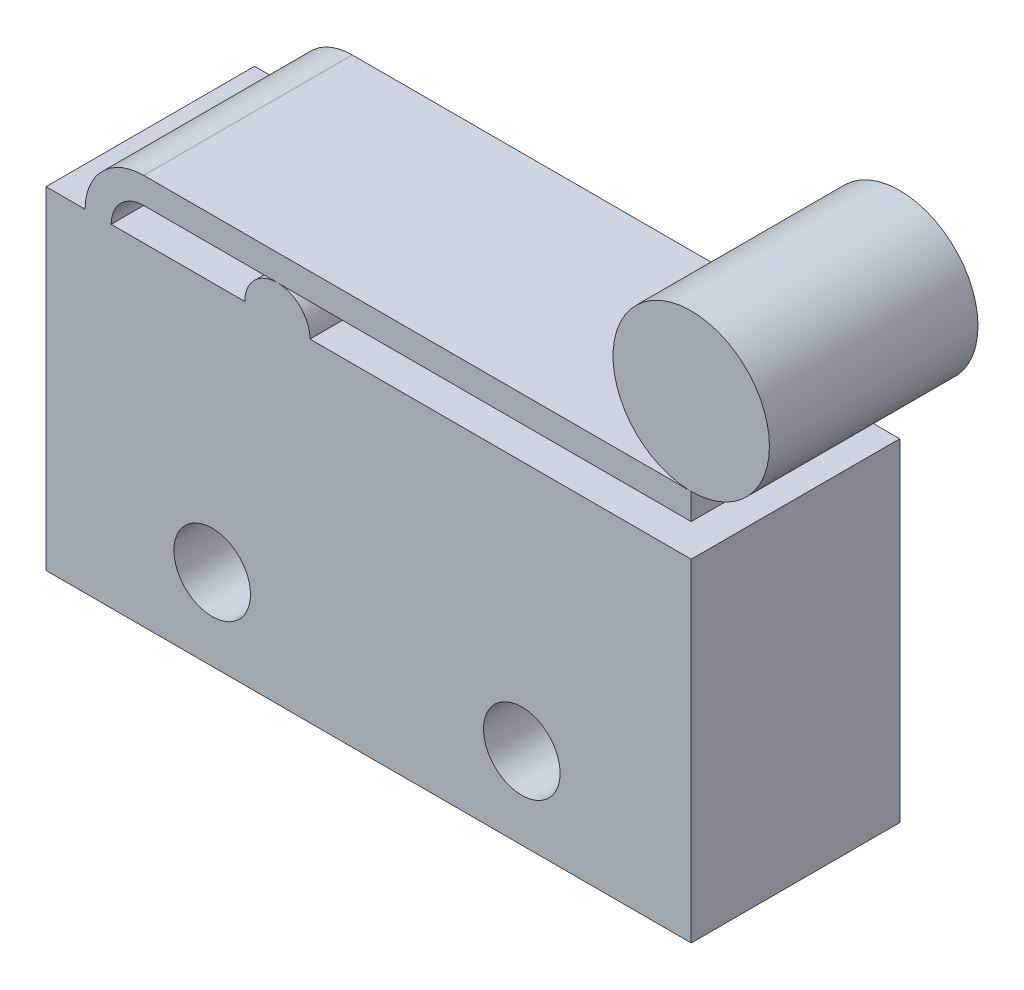
ISO-10303-21;
HEADER;
FILE_DESCRIPTION(('STEP AP214'),'2;1');
FILE_NAME('part.step','',(''),(''),'','','');
FILE_SCHEMA(('AUTOMOTIVE_DESIGN { 1 0 10303 214 1 1 1 1 }'));
ENDSEC;
DATA;
#1=APPLICATION_CONTEXT('core data for automotive mechanical design processes');
#2=APPLICATION_PROTOCOL_DEFINITION('international standard','automotive_design',2000,#1);
#3=PRODUCT_CONTEXT('',#1,'mechanical');
#4=PRODUCT('Part','Part','',(#3));
#5=PRODUCT_RELATED_PRODUCT_CATEGORY('part','',(#4));
#6=PRODUCT_DEFINITION_FORMATION('','',#4);
#7=PRODUCT_DEFINITION_CONTEXT('part definition',#1,'design');
#8=PRODUCT_DEFINITION('design','',#6,#7);
#9=PRODUCT_DEFINITION_SHAPE('','',#8);
#10=(LENGTH_UNIT() NAMED_UNIT(*) SI_UNIT(.MILLI.,.METRE.));
#11=(NAMED_UNIT(*) PLANE_ANGLE_UNIT() SI_UNIT($,.RADIAN.));
#12=(NAMED_UNIT(*) SI_UNIT($,.STERADIAN.) SOLID_ANGLE_UNIT());
#13=UNCERTAINTY_MEASURE_WITH_UNIT(LENGTH_MEASURE(1.E-05),#10,'distance_accuracy_value','');
#14=(GEOMETRIC_REPRESENTATION_CONTEXT(3) GLOBAL_UNCERTAINTY_ASSIGNED_CONTEXT((#13)) GLOBAL_UNIT_ASSIGNED_CONTEXT((#10,
#11,#12)) REPRESENTATION_CONTEXT('',''));
#15=CARTESIAN_POINT('',(0.,0.,0.));
#16=DIRECTION('',(0.,0.,1.));
#17=DIRECTION('',(1.,0.,0.));
#18=AXIS2_PLACEMENT_3D('',#15,#16,#17);
#19=CARTESIAN_POINT('',(19.8,14.4,6.4));
#20=DIRECTION('',(0.,0.,1.));
#21=DIRECTION('',(1.,0.,0.));
#22=AXIS2_PLACEMENT_3D('',#19,#20,#21);
#23=PLANE('',#22);
#24=CARTESIAN_POINT('',(19.8,14.4,6.4));
#25=DIRECTION('',(0.,0.,1.));
#26=DIRECTION('',(1.,0.,0.));
#27=AXIS2_PLACEMENT_3D('',#24,#25,#26);
#28=CIRCLE('',#27,2.4);
#29=CARTESIAN_POINT('',(22.2,14.4,6.4));
#30=VERTEX_POINT('',#29);
#31=EDGE_CURVE('P0_E18',#30,#30,#28,.F.);
#32=ORIENTED_EDGE('',*,*,#31,.F.);
#33=EDGE_LOOP('',(#32));
#34=FACE_BOUND('',#33,.T.);
#35=ADVANCED_FACE('P0_F15',(#34),#23,.T.);
#36=CARTESIAN_POINT('',(19.8,14.4,0.));
#37=DIRECTION('',(0.,0.,1.));
#38=DIRECTION('',(1.,0.,0.));
#39=AXIS2_PLACEMENT_3D('',#36,#37,#38);
#40=PLANE('',#39);
#41=CARTESIAN_POINT('',(19.8,14.4,0.));
#42=DIRECTION('',(0.,0.,1.));
#43=DIRECTION('',(1.,0.,0.));
#44=AXIS2_PLACEMENT_3D('',#41,#42,#43);
#45=CIRCLE('',#44,2.4);
#46=CARTESIAN_POINT('',(22.2,14.4,0.));
#47=VERTEX_POINT('',#46);
#48=EDGE_CURVE('P0_E10',#47,#47,#45,.T.);
#49=ORIENTED_EDGE('',*,*,#48,.F.);
#50=EDGE_LOOP('',(#49));
#51=FACE_BOUND('',#50,.T.);
#52=ADVANCED_FACE('P0_F30',(#51),#40,.F.);
#53=CARTESIAN_POINT('',(19.8,14.4,0.));
#54=DIRECTION('',(0.,0.,1.));
#55=DIRECTION('',(1.,0.,0.));
#56=AXIS2_PLACEMENT_3D('',#53,#54,#55);
#57=CYLINDRICAL_SURFACE('',#56,2.4);
#58=ORIENTED_EDGE('',*,*,#31,.T.);
#59=EDGE_LOOP('',(#58));
#60=FACE_BOUND('',#59,.T.);
#61=ORIENTED_EDGE('',*,*,#48,.T.);
#62=EDGE_LOOP('',(#61));
#63=FACE_BOUND('',#62,.T.);
#64=ADVANCED_FACE('P0_F27',(#60,#63),#57,.T.);
#65=CLOSED_SHELL('',(#35,#52,#64));
#66=MANIFOLD_SOLID_BREP('P0_B1',#65);
#67=CARTESIAN_POINT('',(9.9,6.00000008940697,0.));
#68=DIRECTION('',(0.,0.,1.));
#69=DIRECTION('',(1.,0.,0.));
#70=AXIS2_PLACEMENT_3D('',#67,#68,#69);
#71=PLANE('',#70);
#72=CARTESIAN_POINT('',(3.00000004470348,10.2,0.));
#73=DIRECTION('',(0.,0.,1.));
#74=DIRECTION('',(1.,0.,0.));
#75=AXIS2_PLACEMENT_3D('',#72,#73,#74);
#76=CIRCLE('',#75,1.);
#77=CARTESIAN_POINT('',(3.00000004470348,11.2,0.));
#78=VERTEX_POINT('',#77);
#79=CARTESIAN_POINT('',(2.00000004470348,10.2,0.));
#80=VERTEX_POINT('',#79);
#81=EDGE_CURVE('P1_E33',#78,#80,#76,.T.);
#82=ORIENTED_EDGE('',*,*,#81,.F.);
#83=DIRECTION('',(1.,0.,0.));
#84=VECTOR('',#83,1.);
#85=CARTESIAN_POINT('',(9.9,11.2,0.));
#86=LINE('',#85,#84);
#87=CARTESIAN_POINT('',(7.1,11.2,0.));
#88=VERTEX_POINT('',#87);
#89=EDGE_CURVE('P1_E11',#78,#88,#86,.T.);
#90=ORIENTED_EDGE('',*,*,#89,.T.);
#91=CARTESIAN_POINT('',(7.1,10.2,0.));
#92=DIRECTION('',(0.,0.,1.));
#93=DIRECTION('',(1.,0.,0.));
#94=AXIS2_PLACEMENT_3D('',#91,#92,#93);
#95=CIRCLE('',#94,1.);
#96=CARTESIAN_POINT('',(6.1,10.2,0.));
#97=VERTEX_POINT('',#96);
#98=EDGE_CURVE('P1_E148',#88,#97,#95,.T.);
#99=ORIENTED_EDGE('',*,*,#98,.T.);
#100=DIRECTION('',(1.,0.,0.));
#101=VECTOR('',#100,1.);
#102=CARTESIAN_POINT('',(9.9,10.2,0.));
#103=LINE('',#102,#101);
#104=EDGE_CURVE('P1_E25',#97,#80,#103,.F.);
#105=ORIENTED_EDGE('',*,*,#104,.T.);
#106=EDGE_LOOP('',(#82,#90,#99,#105));
#107=FACE_BOUND('',#106,.T.);
#108=CARTESIAN_POINT('',(5.1,2.5,0.));
#109=DIRECTION('',(0.,0.,1.));
#110=DIRECTION('',(1.,0.,0.));
#111=AXIS2_PLACEMENT_3D('',#108,#109,#110);
#112=CIRCLE('',#111,1.175);
#113=CARTESIAN_POINT('',(6.275,2.5,0.));
#114=VERTEX_POINT('',#113);
#115=EDGE_CURVE('P1_E155',#114,#114,#112,.F.);
#116=ORIENTED_EDGE('',*,*,#115,.T.);
#117=EDGE_LOOP('',(#116));
#118=FACE_BOUND('',#117,.T.);
#119=CARTESIAN_POINT('',(14.6,2.5,0.));
#120=DIRECTION('',(0.,0.,1.));
#121=DIRECTION('',(1.,0.,0.));
#122=AXIS2_PLACEMENT_3D('',#119,#120,#121);
#123=CIRCLE('',#122,1.175);
#124=CARTESIAN_POINT('',(15.775,2.5,0.));
#125=VERTEX_POINT('',#124);
#126=EDGE_CURVE('P1_E158',#125,#125,#123,.F.);
#127=ORIENTED_EDGE('',*,*,#126,.T.);
#128=EDGE_LOOP('',(#127));
#129=FACE_BOUND('',#128,.T.);
#130=DIRECTION('',(0.,1.,0.));
#131=VECTOR('',#130,1.);
#132=CARTESIAN_POINT('',(0.,6.00000008940697,0.));
#133=LINE('',#132,#131);
#134=CARTESIAN_POINT('',(0.,10.2,0.));
#135=VERTEX_POINT('',#134);
#136=CARTESIAN_POINT('',(0.,0.,0.));
#137=VERTEX_POINT('',#136);
#138=EDGE_CURVE('P1_E164',#135,#137,#133,.F.);
#139=ORIENTED_EDGE('',*,*,#138,.T.);
#140=DIRECTION('',(1.,0.,0.));
#141=VECTOR('',#140,1.);
#142=CARTESIAN_POINT('',(9.9,0.,0.));
#143=LINE('',#142,#141);
#144=CARTESIAN_POINT('',(19.8,0.,0.));
#145=VERTEX_POINT('',#144);
#146=EDGE_CURVE('P1_E161',#137,#145,#143,.T.);
#147=ORIENTED_EDGE('',*,*,#146,.T.);
#148=DIRECTION('',(0.,1.,0.));
#149=VECTOR('',#148,1.);
#150=CARTESIAN_POINT('',(19.8,6.00000008940697,0.));
#151=LINE('',#150,#149);
#152=CARTESIAN_POINT('',(19.8,10.2,0.));
#153=VERTEX_POINT('',#152);
#154=EDGE_CURVE('P1_E177',#145,#153,#151,.T.);
#155=ORIENTED_EDGE('',*,*,#154,.T.);
#156=DIRECTION('',(1.,0.,0.));
#157=VECTOR('',#156,1.);
#158=CARTESIAN_POINT('',(9.9,10.2,0.));
#159=LINE('',#158,#157);
#160=CARTESIAN_POINT('',(8.1,10.2,0.));
#161=VERTEX_POINT('',#160);
#162=EDGE_CURVE('P1_E135',#153,#161,#159,.F.);
#163=ORIENTED_EDGE('',*,*,#162,.T.);
#164=CARTESIAN_POINT('',(7.1,10.2,0.));
#165=DIRECTION('',(0.,0.,1.));
#166=DIRECTION('',(1.,0.,0.));
#167=AXIS2_PLACEMENT_3D('',#164,#165,#166);
#168=CIRCLE('',#167,1.);
#169=CARTESIAN_POINT('',(7.1,11.2,0.));
#170=VERTEX_POINT('',#169);
#171=EDGE_CURVE('P1_E20',#161,#170,#168,.T.);
#172=ORIENTED_EDGE('',*,*,#171,.T.);
#173=DIRECTION('',(1.,0.,0.));
#174=VECTOR('',#173,1.);
#175=CARTESIAN_POINT('',(9.9,11.2,0.));
#176=LINE('',#175,#174);
#177=CARTESIAN_POINT('',(19.8,11.2,0.));
#178=VERTEX_POINT('',#177);
#179=EDGE_CURVE('P1_E173',#170,#178,#176,.T.);
#180=ORIENTED_EDGE('',*,*,#179,.T.);
#181=DIRECTION('',(0.,1.,0.));
#182=VECTOR('',#181,1.);
#183=CARTESIAN_POINT('',(19.8,6.00000008940697,0.));
#184=LINE('',#183,#182);
#185=CARTESIAN_POINT('',(19.8,12.0000001788139,0.));
#186=VERTEX_POINT('',#185);
#187=EDGE_CURVE('P1_E152',#178,#186,#184,.T.);
#188=ORIENTED_EDGE('',*,*,#187,.T.);
#189=DIRECTION('',(1.,0.,0.));
#190=VECTOR('',#189,1.);
#191=CARTESIAN_POINT('',(9.9,12.0000001788139,0.));
#192=LINE('',#191,#190);
#193=CARTESIAN_POINT('',(3.00000004470348,12.0000001788139,0.));
#194=VERTEX_POINT('',#193);
#195=EDGE_CURVE('P1_E170',#186,#194,#192,.F.);
#196=ORIENTED_EDGE('',*,*,#195,.T.);
#197=CARTESIAN_POINT('',(3.00000004470348,10.2,0.));
#198=DIRECTION('',(0.,0.,1.));
#199=DIRECTION('',(1.,0.,0.));
#200=AXIS2_PLACEMENT_3D('',#197,#198,#199);
#201=CIRCLE('',#200,1.80000017881393);
#202=CARTESIAN_POINT('',(1.19999986588955,10.2,0.));
#203=VERTEX_POINT('',#202);
#204=EDGE_CURVE('P1_E167',#194,#203,#201,.T.);
#205=ORIENTED_EDGE('',*,*,#204,.T.);
#206=DIRECTION('',(1.,0.,0.));
#207=VECTOR('',#206,1.);
#208=CARTESIAN_POINT('',(9.9,10.2,0.));
#209=LINE('',#208,#207);
#210=EDGE_CURVE('P1_E223',#203,#135,#209,.F.);
#211=ORIENTED_EDGE('',*,*,#210,.T.);
#212=EDGE_LOOP('',(#139,#147,#155,#163,#172,#180,#188,#196,#205,#211));
#213=FACE_BOUND('',#212,.T.);
#214=ADVANCED_FACE('P1_F17',(#107,#118,#129,#213),#71,.T.);
#215=CARTESIAN_POINT('',(3.00000004470348,11.2,0.));
#216=DIRECTION('',(0.,-1.,0.));
#217=DIRECTION('',(0.,0.,-1.));
#218=AXIS2_PLACEMENT_3D('',#215,#216,#217);
#219=PLANE('',#218);
#220=DIRECTION('',(1.,0.,0.));
#221=VECTOR('',#220,1.);
#222=CARTESIAN_POINT('',(9.9,11.2,6.4));
#223=LINE('',#222,#221);
#224=CARTESIAN_POINT('',(7.1,11.2,6.4));
#225=VERTEX_POINT('',#224);
#226=CARTESIAN_POINT('',(3.00000004470348,11.2,6.4));
#227=VERTEX_POINT('',#226);
#228=EDGE_CURVE('P1_E180',#225,#227,#223,.F.);
#229=ORIENTED_EDGE('',*,*,#228,.F.);
#230=DIRECTION('',(0.,0.,-1.));
#231=VECTOR('',#230,1.);
#232=CARTESIAN_POINT('',(7.1,11.2,0.));
#233=LINE('',#232,#231);
#234=EDGE_CURVE('P1_E182',#88,#225,#233,.F.);
#235=ORIENTED_EDGE('',*,*,#234,.F.);
#236=ORIENTED_EDGE('',*,*,#89,.F.);
#237=DIRECTION('',(0.,0.,-1.));
#238=VECTOR('',#237,1.);
#239=CARTESIAN_POINT('',(3.00000004470348,11.2,0.));
#240=LINE('',#239,#238);
#241=EDGE_CURVE('P1_E179',#227,#78,#240,.T.);
#242=ORIENTED_EDGE('',*,*,#241,.F.);
#243=EDGE_LOOP('',(#229,#235,#236,#242));
#244=FACE_BOUND('',#243,.T.);
#245=ADVANCED_FACE('P1_F313',(#244),#219,.F.);
#246=CARTESIAN_POINT('',(6.1,10.2,0.));
#247=DIRECTION('',(0.,1.,0.));
#248=DIRECTION('',(0.,0.,1.));
#249=AXIS2_PLACEMENT_3D('',#246,#247,#248);
#250=PLANE('',#249);
#251=DIRECTION('',(1.,0.,0.));
#252=VECTOR('',#251,1.);
#253=CARTESIAN_POINT('',(9.9,10.2,6.4));
#254=LINE('',#253,#252);
#255=CARTESIAN_POINT('',(2.00000004470348,10.2,6.4));
#256=VERTEX_POINT('',#255);
#257=CARTESIAN_POINT('',(6.1,10.2,6.4));
#258=VERTEX_POINT('',#257);
#259=EDGE_CURVE('P1_E183',#256,#258,#254,.T.);
#260=ORIENTED_EDGE('',*,*,#259,.F.);
#261=DIRECTION('',(0.,0.,1.));
#262=VECTOR('',#261,1.);
#263=CARTESIAN_POINT('',(2.00000004470348,10.2,0.));
#264=LINE('',#263,#262);
#265=EDGE_CURVE('P1_E187',#80,#256,#264,.T.);
#266=ORIENTED_EDGE('',*,*,#265,.F.);
#267=ORIENTED_EDGE('',*,*,#104,.F.);
#268=DIRECTION('',(0.,0.,1.));
#269=VECTOR('',#268,1.);
#270=CARTESIAN_POINT('',(6.1,10.2,0.));
#271=LINE('',#270,#269);
#272=EDGE_CURVE('P1_E186',#258,#97,#271,.F.);
#273=ORIENTED_EDGE('',*,*,#272,.F.);
#274=EDGE_LOOP('',(#260,#266,#267,#273));
#275=FACE_BOUND('',#274,.T.);
#276=ADVANCED_FACE('P1_F309',(#275),#250,.F.);
#277=CARTESIAN_POINT('',(5.1,2.5,0.));
#278=DIRECTION('',(0.,0.,1.));
#279=DIRECTION('',(1.,0.,0.));
#280=AXIS2_PLACEMENT_3D('',#277,#278,#279);
#281=CYLINDRICAL_SURFACE('',#280,1.175);
#282=ORIENTED_EDGE('',*,*,#115,.F.);
#283=EDGE_LOOP('',(#282));
#284=FACE_BOUND('',#283,.T.);
#285=CARTESIAN_POINT('',(5.1,2.5,6.4));
#286=DIRECTION('',(0.,0.,1.));
#287=DIRECTION('',(1.,0.,0.));
#288=AXIS2_PLACEMENT_3D('',#285,#286,#287);
#289=CIRCLE('',#288,1.175);
#290=CARTESIAN_POINT('',(6.275,2.5,6.4));
#291=VERTEX_POINT('',#290);
#292=EDGE_CURVE('P1_E188',#291,#291,#289,.F.);
#293=ORIENTED_EDGE('',*,*,#292,.T.);
#294=EDGE_LOOP('',(#293));
#295=FACE_BOUND('',#294,.T.);
#296=ADVANCED_FACE('P1_F305',(#284,#295),#281,.T.);
#297=CARTESIAN_POINT('',(14.6,2.5,0.));
#298=DIRECTION('',(0.,0.,1.));
#299=DIRECTION('',(1.,0.,0.));
#300=AXIS2_PLACEMENT_3D('',#297,#298,#299);
#301=CYLINDRICAL_SURFACE('',#300,1.175);
#302=ORIENTED_EDGE('',*,*,#126,.F.);
#303=EDGE_LOOP('',(#302));
#304=FACE_BOUND('',#303,.T.);
#305=CARTESIAN_POINT('',(14.6,2.5,6.4));
#306=DIRECTION('',(0.,0.,1.));
#307=DIRECTION('',(1.,0.,0.));
#308=AXIS2_PLACEMENT_3D('',#305,#306,#307);
#309=CIRCLE('',#308,1.175);
#310=CARTESIAN_POINT('',(15.775,2.5,6.4));
#311=VERTEX_POINT('',#310);
#312=EDGE_CURVE('P1_E191',#311,#311,#309,.F.);
#313=ORIENTED_EDGE('',*,*,#312,.T.);
#314=EDGE_LOOP('',(#313));
#315=FACE_BOUND('',#314,.T.);
#316=ADVANCED_FACE('P1_F302',(#304,#315),#301,.T.);
#317=CARTESIAN_POINT('',(0.,0.,0.));
#318=DIRECTION('',(0.,-1.,0.));
#319=DIRECTION('',(0.,0.,-1.));
#320=AXIS2_PLACEMENT_3D('',#317,#318,#319);
#321=PLANE('',#320);
#322=DIRECTION('',(1.,0.,0.));
#323=VECTOR('',#322,1.);
#324=CARTESIAN_POINT('',(9.9,0.,6.4));
#325=LINE('',#324,#323);
#326=CARTESIAN_POINT('',(19.8,0.,6.4));
#327=VERTEX_POINT('',#326);
#328=CARTESIAN_POINT('',(0.,0.,6.4));
#329=VERTEX_POINT('',#328);
#330=EDGE_CURVE('P1_E195',#327,#329,#325,.F.);
#331=ORIENTED_EDGE('',*,*,#330,.F.);
#332=DIRECTION('',(0.,0.,-1.));
#333=VECTOR('',#332,1.);
#334=CARTESIAN_POINT('',(19.8,0.,0.));
#335=LINE('',#334,#333);
#336=EDGE_CURVE('P1_E130',#145,#327,#335,.F.);
#337=ORIENTED_EDGE('',*,*,#336,.F.);
#338=ORIENTED_EDGE('',*,*,#146,.F.);
#339=DIRECTION('',(0.,0.,-1.));
#340=VECTOR('',#339,1.);
#341=CARTESIAN_POINT('',(0.,0.,0.));
#342=LINE('',#341,#340);
#343=EDGE_CURVE('P1_E194',#329,#137,#342,.T.);
#344=ORIENTED_EDGE('',*,*,#343,.F.);
#345=EDGE_LOOP('',(#331,#337,#338,#344));
#346=FACE_BOUND('',#345,.T.);
#347=ADVANCED_FACE('P1_F260',(#346),#321,.F.);
#348=CARTESIAN_POINT('',(0.,10.2,0.));
#349=DIRECTION('',(-1.,0.,0.));
#350=DIRECTION('',(0.,0.,1.));
#351=AXIS2_PLACEMENT_3D('',#348,#349,#350);
#352=PLANE('',#351);
#353=DIRECTION('',(0.,1.,0.));
#354=VECTOR('',#353,1.);
#355=CARTESIAN_POINT('',(0.,6.00000008940697,6.4));
#356=LINE('',#355,#354);
#357=CARTESIAN_POINT('',(0.,10.2,6.4));
#358=VERTEX_POINT('',#357);
#359=EDGE_CURVE('P1_E197',#329,#358,#356,.T.);
#360=ORIENTED_EDGE('',*,*,#359,.F.);
#361=ORIENTED_EDGE('',*,*,#343,.T.);
#362=ORIENTED_EDGE('',*,*,#138,.F.);
#363=DIRECTION('',(0.,0.,1.));
#364=VECTOR('',#363,1.);
#365=CARTESIAN_POINT('',(0.,10.2,0.));
#366=LINE('',#365,#364);
#367=EDGE_CURVE('P1_E200',#358,#135,#366,.F.);
#368=ORIENTED_EDGE('',*,*,#367,.F.);
#369=EDGE_LOOP('',(#360,#361,#362,#368));
#370=FACE_BOUND('',#369,.T.);
#371=ADVANCED_FACE('P1_F254',(#370),#352,.F.);
#372=CARTESIAN_POINT('',(3.00000004470348,10.2,0.));
#373=DIRECTION('',(0.,0.,1.));
#374=DIRECTION('',(1.,0.,0.));
#375=AXIS2_PLACEMENT_3D('',#372,#373,#374);
#376=CYLINDRICAL_SURFACE('',#375,1.80000017881393);
#377=CARTESIAN_POINT('',(3.00000004470348,10.2,6.4));
#378=DIRECTION('',(0.,0.,1.));
#379=DIRECTION('',(1.,0.,0.));
#380=AXIS2_PLACEMENT_3D('',#377,#378,#379);
#381=CIRCLE('',#380,1.80000017881393);
#382=CARTESIAN_POINT('',(1.19999986588955,10.2,6.4));
#383=VERTEX_POINT('',#382);
#384=CARTESIAN_POINT('',(3.00000004470348,12.0000001788139,6.4));
#385=VERTEX_POINT('',#384);
#386=EDGE_CURVE('P1_E202',#383,#385,#381,.F.);
#387=ORIENTED_EDGE('',*,*,#386,.F.);
#388=DIRECTION('',(0.,0.,1.));
#389=VECTOR('',#388,1.);
#390=CARTESIAN_POINT('',(1.19999986588955,10.2,0.));
#391=LINE('',#390,#389);
#392=EDGE_CURVE('P1_E204',#203,#383,#391,.T.);
#393=ORIENTED_EDGE('',*,*,#392,.F.);
#394=ORIENTED_EDGE('',*,*,#204,.F.);
#395=DIRECTION('',(0.,0.,1.));
#396=VECTOR('',#395,1.);
#397=CARTESIAN_POINT('',(3.00000004470348,12.0000001788139,0.));
#398=LINE('',#397,#396);
#399=EDGE_CURVE('P1_E201',#385,#194,#398,.F.);
#400=ORIENTED_EDGE('',*,*,#399,.F.);
#401=EDGE_LOOP('',(#387,#393,#394,#400));
#402=FACE_BOUND('',#401,.T.);
#403=ADVANCED_FACE('P1_F244',(#402),#376,.F.);
#404=CARTESIAN_POINT('',(19.8,12.0000001788139,0.));
#405=DIRECTION('',(0.,1.,0.));
#406=DIRECTION('',(0.,0.,1.));
#407=AXIS2_PLACEMENT_3D('',#404,#405,#406);
#408=PLANE('',#407);
#409=DIRECTION('',(1.,0.,0.));
#410=VECTOR('',#409,1.);
#411=CARTESIAN_POINT('',(9.9,12.0000001788139,6.4));
#412=LINE('',#411,#410);
#413=CARTESIAN_POINT('',(19.8,12.0000001788139,6.4));
#414=VERTEX_POINT('',#413);
#415=EDGE_CURVE('P1_E205',#385,#414,#412,.T.);
#416=ORIENTED_EDGE('',*,*,#415,.F.);
#417=ORIENTED_EDGE('',*,*,#399,.T.);
#418=ORIENTED_EDGE('',*,*,#195,.F.);
#419=DIRECTION('',(0.,0.,1.));
#420=VECTOR('',#419,1.);
#421=CARTESIAN_POINT('',(19.8,12.0000001788139,0.));
#422=LINE('',#421,#420);
#423=EDGE_CURVE('P1_E208',#414,#186,#422,.F.);
#424=ORIENTED_EDGE('',*,*,#423,.F.);
#425=EDGE_LOOP('',(#416,#417,#418,#424));
#426=FACE_BOUND('',#425,.T.);
#427=ADVANCED_FACE('P1_F237',(#426),#408,.F.);
#428=CARTESIAN_POINT('',(7.1,11.2,0.));
#429=DIRECTION('',(0.,-1.,0.));
#430=DIRECTION('',(0.,0.,-1.));
#431=AXIS2_PLACEMENT_3D('',#428,#429,#430);
#432=PLANE('',#431);
#433=DIRECTION('',(1.,0.,0.));
#434=VECTOR('',#433,1.);
#435=CARTESIAN_POINT('',(9.9,11.2,6.4));
#436=LINE('',#435,#434);
#437=CARTESIAN_POINT('',(19.8,11.2,6.4));
#438=VERTEX_POINT('',#437);
#439=CARTESIAN_POINT('',(7.1,11.2,6.4));
#440=VERTEX_POINT('',#439);
#441=EDGE_CURVE('P1_E139',#438,#440,#436,.F.);
#442=ORIENTED_EDGE('',*,*,#441,.F.);
#443=DIRECTION('',(0.,0.,-1.));
#444=VECTOR('',#443,1.);
#445=CARTESIAN_POINT('',(19.8,11.2,0.));
#446=LINE('',#445,#444);
#447=EDGE_CURVE('P1_E137',#178,#438,#446,.F.);
#448=ORIENTED_EDGE('',*,*,#447,.F.);
#449=ORIENTED_EDGE('',*,*,#179,.F.);
#450=DIRECTION('',(0.,0.,-1.));
#451=VECTOR('',#450,1.);
#452=CARTESIAN_POINT('',(7.1,11.2,0.));
#453=LINE('',#452,#451);
#454=EDGE_CURVE('P1_E209',#440,#170,#453,.T.);
#455=ORIENTED_EDGE('',*,*,#454,.F.);
#456=EDGE_LOOP('',(#442,#448,#449,#455));
#457=FACE_BOUND('',#456,.T.);
#458=ADVANCED_FACE('P1_F266',(#457),#432,.F.);
#459=CARTESIAN_POINT('',(19.8,10.2,0.));
#460=DIRECTION('',(0.,1.,0.));
#461=DIRECTION('',(0.,0.,1.));
#462=AXIS2_PLACEMENT_3D('',#459,#460,#461);
#463=PLANE('',#462);
#464=DIRECTION('',(1.,0.,0.));
#465=VECTOR('',#464,1.);
#466=CARTESIAN_POINT('',(9.9,10.2,6.4));
#467=LINE('',#466,#465);
#468=CARTESIAN_POINT('',(8.1,10.2,6.4));
#469=VERTEX_POINT('',#468);
#470=CARTESIAN_POINT('',(19.8,10.2,6.4));
#471=VERTEX_POINT('',#470);
#472=EDGE_CURVE('P1_E118',#469,#471,#467,.T.);
#473=ORIENTED_EDGE('',*,*,#472,.F.);
#474=DIRECTION('',(0.,0.,1.));
#475=VECTOR('',#474,1.);
#476=CARTESIAN_POINT('',(8.1,10.2,0.));
#477=LINE('',#476,#475);
#478=EDGE_CURVE('P1_E126',#161,#469,#477,.T.);
#479=ORIENTED_EDGE('',*,*,#478,.F.);
#480=ORIENTED_EDGE('',*,*,#162,.F.);
#481=DIRECTION('',(0.,0.,1.));
#482=VECTOR('',#481,1.);
#483=CARTESIAN_POINT('',(19.8,10.2,0.));
#484=LINE('',#483,#482);
#485=EDGE_CURVE('P1_E105',#471,#153,#484,.F.);
#486=ORIENTED_EDGE('',*,*,#485,.F.);
#487=EDGE_LOOP('',(#473,#479,#480,#486));
#488=FACE_BOUND('',#487,.T.);
#489=ADVANCED_FACE('P1_F133',(#488),#463,.F.);
#490=CARTESIAN_POINT('',(19.8,0.,0.));
#491=DIRECTION('',(1.,0.,0.));
#492=DIRECTION('',(0.,0.,-1.));
#493=AXIS2_PLACEMENT_3D('',#490,#491,#492);
#494=PLANE('',#493);
#495=DIRECTION('',(0.,1.,0.));
#496=VECTOR('',#495,1.);
#497=CARTESIAN_POINT('',(19.8,6.00000008940697,6.4));
#498=LINE('',#497,#496);
#499=EDGE_CURVE('P1_E121',#471,#327,#498,.F.);
#500=ORIENTED_EDGE('',*,*,#499,.F.);
#501=ORIENTED_EDGE('',*,*,#485,.T.);
#502=ORIENTED_EDGE('',*,*,#154,.F.);
#503=ORIENTED_EDGE('',*,*,#336,.T.);
#504=EDGE_LOOP('',(#500,#501,#502,#503));
#505=FACE_BOUND('',#504,.T.);
#506=ADVANCED_FACE('P1_F128',(#505),#494,.F.);
#507=CARTESIAN_POINT('',(3.00000004470348,10.2,0.));
#508=DIRECTION('',(0.,0.,1.));
#509=DIRECTION('',(1.,0.,0.));
#510=AXIS2_PLACEMENT_3D('',#507,#508,#509);
#511=CYLINDRICAL_SURFACE('',#510,1.);
#512=ORIENTED_EDGE('',*,*,#241,.T.);
#513=ORIENTED_EDGE('',*,*,#81,.T.);
#514=ORIENTED_EDGE('',*,*,#265,.T.);
#515=CARTESIAN_POINT('',(3.00000004470348,10.2,6.4));
#516=DIRECTION('',(0.,0.,1.));
#517=DIRECTION('',(1.,0.,0.));
#518=AXIS2_PLACEMENT_3D('',#515,#516,#517);
#519=CIRCLE('',#518,1.);
#520=EDGE_CURVE('P1_E212',#256,#227,#519,.F.);
#521=ORIENTED_EDGE('',*,*,#520,.T.);
#522=EDGE_LOOP('',(#512,#513,#514,#521));
#523=FACE_BOUND('',#522,.T.);
#524=ADVANCED_FACE('P1_F283',(#523),#511,.T.);
#525=CARTESIAN_POINT('',(9.9,6.00000008940697,6.4));
#526=DIRECTION('',(0.,0.,1.));
#527=DIRECTION('',(1.,0.,0.));
#528=AXIS2_PLACEMENT_3D('',#525,#526,#527);
#529=PLANE('',#528);
#530=ORIENTED_EDGE('',*,*,#520,.F.);
#531=ORIENTED_EDGE('',*,*,#259,.T.);
#532=CARTESIAN_POINT('',(7.1,10.2,6.4));
#533=DIRECTION('',(0.,0.,1.));
#534=DIRECTION('',(1.,0.,0.));
#535=AXIS2_PLACEMENT_3D('',#532,#533,#534);
#536=CIRCLE('',#535,1.);
#537=EDGE_CURVE('P1_E215',#225,#258,#536,.T.);
#538=ORIENTED_EDGE('',*,*,#537,.F.);
#539=ORIENTED_EDGE('',*,*,#228,.T.);
#540=EDGE_LOOP('',(#530,#531,#538,#539));
#541=FACE_BOUND('',#540,.T.);
#542=ORIENTED_EDGE('',*,*,#292,.F.);
#543=EDGE_LOOP('',(#542));
#544=FACE_BOUND('',#543,.T.);
#545=ORIENTED_EDGE('',*,*,#312,.F.);
#546=EDGE_LOOP('',(#545));
#547=FACE_BOUND('',#546,.T.);
#548=DIRECTION('',(1.,0.,0.));
#549=VECTOR('',#548,1.);
#550=CARTESIAN_POINT('',(1.19999986588955,10.2,6.4));
#551=LINE('',#550,#549);
#552=EDGE_CURVE('P1_E217',#383,#358,#551,.F.);
#553=ORIENTED_EDGE('',*,*,#552,.F.);
#554=ORIENTED_EDGE('',*,*,#386,.T.);
#555=ORIENTED_EDGE('',*,*,#415,.T.);
#556=DIRECTION('',(0.,1.,0.));
#557=VECTOR('',#556,1.);
#558=CARTESIAN_POINT('',(19.8,11.2,6.4));
#559=LINE('',#558,#557);
#560=EDGE_CURVE('P1_E219',#438,#414,#559,.T.);
#561=ORIENTED_EDGE('',*,*,#560,.F.);
#562=ORIENTED_EDGE('',*,*,#441,.T.);
#563=CARTESIAN_POINT('',(7.1,10.2,6.4));
#564=DIRECTION('',(0.,0.,1.));
#565=DIRECTION('',(1.,0.,0.));
#566=AXIS2_PLACEMENT_3D('',#563,#564,#565);
#567=CIRCLE('',#566,1.);
#568=EDGE_CURVE('P1_E124',#469,#440,#567,.T.);
#569=ORIENTED_EDGE('',*,*,#568,.F.);
#570=ORIENTED_EDGE('',*,*,#472,.T.);
#571=ORIENTED_EDGE('',*,*,#499,.T.);
#572=ORIENTED_EDGE('',*,*,#330,.T.);
#573=ORIENTED_EDGE('',*,*,#359,.T.);
#574=EDGE_LOOP('',(#553,#554,#555,#561,#562,#569,#570,#571,#572,#573));
#575=FACE_BOUND('',#574,.T.);
#576=ADVANCED_FACE('P1_F120',(#541,#544,#547,#575),#529,.F.);
#577=CARTESIAN_POINT('',(7.1,10.2,0.));
#578=DIRECTION('',(0.,0.,1.));
#579=DIRECTION('',(1.,0.,0.));
#580=AXIS2_PLACEMENT_3D('',#577,#578,#579);
#581=CYLINDRICAL_SURFACE('',#580,1.);
#582=ORIENTED_EDGE('',*,*,#537,.T.);
#583=ORIENTED_EDGE('',*,*,#272,.T.);
#584=ORIENTED_EDGE('',*,*,#98,.F.);
#585=DIRECTION('',(0.,0.,1.));
#586=VECTOR('',#585,1.);
#587=CARTESIAN_POINT('',(7.1,11.2,0.));
#588=LINE('',#587,#586);
#589=EDGE_CURVE('P1_E144',#225,#88,#588,.F.);
#590=ORIENTED_EDGE('',*,*,#589,.F.);
#591=EDGE_LOOP('',(#582,#583,#584,#590));
#592=FACE_BOUND('',#591,.T.);
#593=ADVANCED_FACE('P1_F275',(#592),#581,.F.);
#594=CARTESIAN_POINT('',(1.19999986588955,10.2,0.));
#595=DIRECTION('',(0.,1.,0.));
#596=DIRECTION('',(0.,0.,1.));
#597=AXIS2_PLACEMENT_3D('',#594,#595,#596);
#598=PLANE('',#597);
#599=ORIENTED_EDGE('',*,*,#552,.T.);
#600=ORIENTED_EDGE('',*,*,#367,.T.);
#601=ORIENTED_EDGE('',*,*,#210,.F.);
#602=ORIENTED_EDGE('',*,*,#392,.T.);
#603=EDGE_LOOP('',(#599,#600,#601,#602));
#604=FACE_BOUND('',#603,.T.);
#605=ADVANCED_FACE('P1_F249',(#604),#598,.F.);
#606=CARTESIAN_POINT('',(19.8,11.2,0.));
#607=DIRECTION('',(1.,0.,0.));
#608=DIRECTION('',(0.,0.,-1.));
#609=AXIS2_PLACEMENT_3D('',#606,#607,#608);
#610=PLANE('',#609);
#611=ORIENTED_EDGE('',*,*,#560,.T.);
#612=ORIENTED_EDGE('',*,*,#423,.T.);
#613=ORIENTED_EDGE('',*,*,#187,.F.);
#614=ORIENTED_EDGE('',*,*,#447,.T.);
#615=EDGE_LOOP('',(#611,#612,#613,#614));
#616=FACE_BOUND('',#615,.T.);
#617=ADVANCED_FACE('P1_F231',(#616),#610,.F.);
#618=CARTESIAN_POINT('',(7.1,10.2,0.));
#619=DIRECTION('',(0.,0.,1.));
#620=DIRECTION('',(1.,0.,0.));
#621=AXIS2_PLACEMENT_3D('',#618,#619,#620);
#622=CYLINDRICAL_SURFACE('',#621,1.);
#623=ORIENTED_EDGE('',*,*,#568,.T.);
#624=DIRECTION('',(0.,0.,1.));
#625=VECTOR('',#624,1.);
#626=CARTESIAN_POINT('',(7.1,11.2,0.));
#627=LINE('',#626,#625);
#628=EDGE_CURVE('P1_E149',#170,#440,#627,.T.);
#629=ORIENTED_EDGE('',*,*,#628,.F.);
#630=ORIENTED_EDGE('',*,*,#171,.F.);
#631=ORIENTED_EDGE('',*,*,#478,.T.);
#632=EDGE_LOOP('',(#623,#629,#630,#631));
#633=FACE_BOUND('',#632,.T.);
#634=ADVANCED_FACE('P1_F18',(#633),#622,.F.);
#635=OPEN_SHELL('',(#214,#245,#276,#296,#316,#347,#371,#403,#427,#458,#489,#506,#524,#576,#593,
#605,#617,#634));
#636=SHELL_BASED_SURFACE_MODEL('P1_B1',(#635));
#637=ADVANCED_BREP_SHAPE_REPRESENTATION('',(#18,#66),#14);
#638=MANIFOLD_SURFACE_SHAPE_REPRESENTATION('',(#18,#636),#14);
#639=SHAPE_REPRESENTATION('',(#18),#14);
#640=SHAPE_DEFINITION_REPRESENTATION(#9,#639);
#641=SHAPE_REPRESENTATION_RELATIONSHIP('','',#639,#637);
#642=SHAPE_REPRESENTATION_RELATIONSHIP('','',#639,#638);
ENDSEC;
END-ISO-10303-21;
